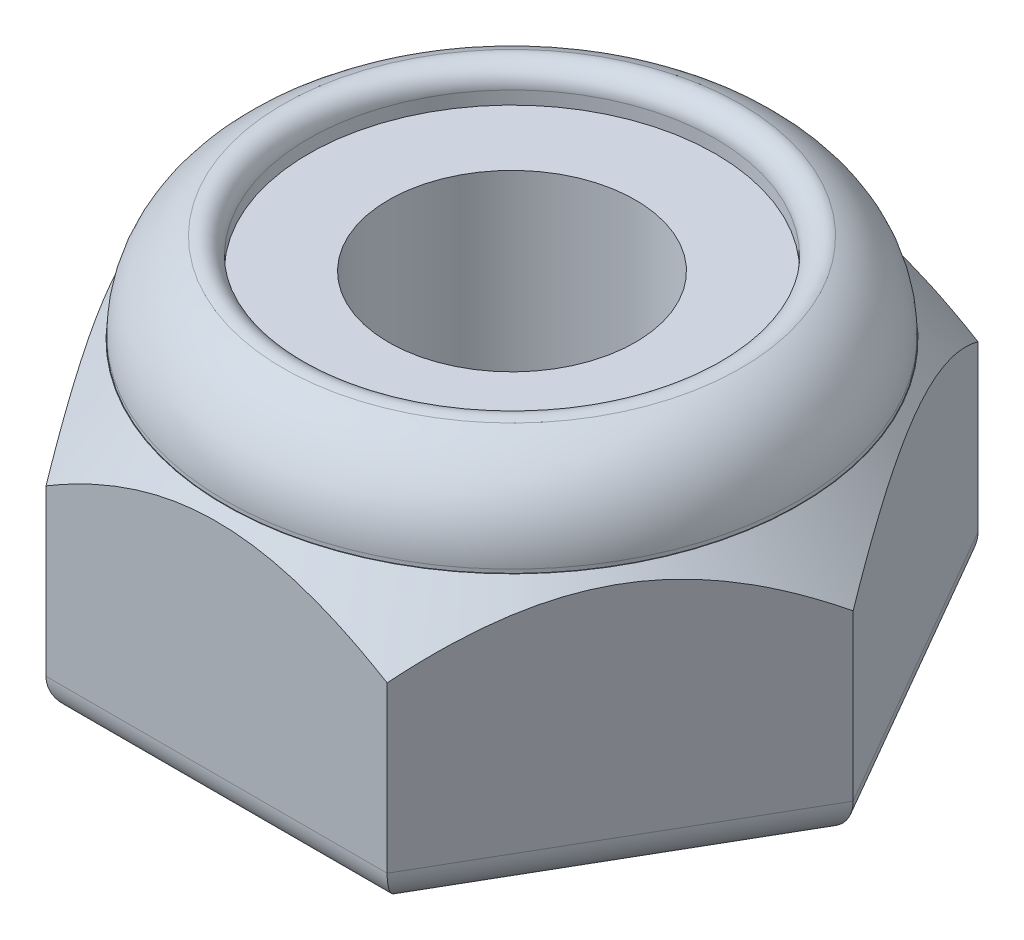
ISO-10303-21;
HEADER;
FILE_DESCRIPTION(('STEP AP214'),'2;1');
FILE_NAME('part.step','',(''),(''),'','','');
FILE_SCHEMA(('AUTOMOTIVE_DESIGN { 1 0 10303 214 1 1 1 1 }'));
ENDSEC;
DATA;
#1=APPLICATION_CONTEXT('core data for automotive mechanical design processes');
#2=APPLICATION_PROTOCOL_DEFINITION('international standard','automotive_design',2000,#1);
#3=PRODUCT_CONTEXT('',#1,'mechanical');
#4=PRODUCT('Part','Part','',(#3));
#5=PRODUCT_RELATED_PRODUCT_CATEGORY('part','',(#4));
#6=PRODUCT_DEFINITION_FORMATION('','',#4);
#7=PRODUCT_DEFINITION_CONTEXT('part definition',#1,'design');
#8=PRODUCT_DEFINITION('design','',#6,#7);
#9=PRODUCT_DEFINITION_SHAPE('','',#8);
#10=(LENGTH_UNIT() NAMED_UNIT(*) SI_UNIT(.MILLI.,.METRE.));
#11=(NAMED_UNIT(*) PLANE_ANGLE_UNIT() SI_UNIT($,.RADIAN.));
#12=(NAMED_UNIT(*) SI_UNIT($,.STERADIAN.) SOLID_ANGLE_UNIT());
#13=UNCERTAINTY_MEASURE_WITH_UNIT(LENGTH_MEASURE(1.E-05),#10,'distance_accuracy_value','');
#14=(GEOMETRIC_REPRESENTATION_CONTEXT(3) GLOBAL_UNCERTAINTY_ASSIGNED_CONTEXT((#13)) GLOBAL_UNIT_ASSIGNED_CONTEXT((#10,
#11,#12)) REPRESENTATION_CONTEXT('',''));
#15=CARTESIAN_POINT('',(0.,0.,0.));
#16=DIRECTION('',(0.,0.,1.));
#17=DIRECTION('',(1.,0.,0.));
#18=AXIS2_PLACEMENT_3D('',#15,#16,#17);
#19=CARTESIAN_POINT('',(0.,4.9784,0.));
#20=DIRECTION('',(0.,-1.,0.));
#21=DIRECTION('',(0.,0.,-1.));
#22=AXIS2_PLACEMENT_3D('',#19,#20,#21);
#23=CYLINDRICAL_SURFACE('',#22,3.937);
#24=CARTESIAN_POINT('',(0.,3.7084,0.));
#25=DIRECTION('',(0.,1.,0.));
#26=DIRECTION('',(0.,0.,1.));
#27=AXIS2_PLACEMENT_3D('',#24,#25,#26);
#28=CIRCLE('',#27,3.937);
#29=CARTESIAN_POINT('',(0.,3.7084,3.937));
#30=VERTEX_POINT('',#29);
#31=EDGE_CURVE('E243',#30,#30,#28,.T.);
#32=ORIENTED_EDGE('',*,*,#31,.F.);
#33=EDGE_LOOP('',(#32));
#34=FACE_BOUND('',#33,.T.);
#35=CARTESIAN_POINT('',(0.,3.6576,0.));
#36=DIRECTION('',(0.,-1.,0.));
#37=DIRECTION('',(0.,0.,-1.));
#38=AXIS2_PLACEMENT_3D('',#35,#36,#37);
#39=CIRCLE('',#38,3.937);
#40=CARTESIAN_POINT('',(0.,3.6576,-3.937));
#41=VERTEX_POINT('',#40);
#42=EDGE_CURVE('E19',#41,#41,#39,.F.);
#43=ORIENTED_EDGE('',*,*,#42,.T.);
#44=EDGE_LOOP('',(#43));
#45=FACE_BOUND('',#44,.T.);
#46=ADVANCED_FACE('F16',(#34,#45),#23,.T.);
#47=CARTESIAN_POINT('',(0.,3.7084,0.));
#48=DIRECTION('',(0.,1.,0.));
#49=DIRECTION('',(0.,0.,1.));
#50=AXIS2_PLACEMENT_3D('',#47,#48,#49);
#51=TOROIDAL_SURFACE('',#50,2.667,1.27);
#52=ORIENTED_EDGE('',*,*,#31,.T.);
#53=EDGE_LOOP('',(#52));
#54=FACE_BOUND('',#53,.T.);
#55=CARTESIAN_POINT('',(0.,4.88572150982644,0.));
#56=DIRECTION('',(0.,-1.,0.));
#57=DIRECTION('',(0.,0.,-1.));
#58=AXIS2_PLACEMENT_3D('',#55,#56,#57);
#59=CIRCLE('',#58,3.14325);
#60=CARTESIAN_POINT('',(0.,4.88572150982644,-3.14325));
#61=VERTEX_POINT('',#60);
#62=EDGE_CURVE('E237',#61,#61,#59,.F.);
#63=ORIENTED_EDGE('',*,*,#62,.F.);
#64=EDGE_LOOP('',(#63));
#65=FACE_BOUND('',#64,.T.);
#66=ADVANCED_FACE('F134',(#54,#65),#51,.T.);
#67=CARTESIAN_POINT('',(2.34315,3.6576,4.05845484975502));
#68=DIRECTION('',(0.,-1.,0.));
#69=DIRECTION('',(0.,0.,-1.));
#70=AXIS2_PLACEMENT_3D('',#67,#68,#69);
#71=PLANE('',#70);
#72=ORIENTED_EDGE('',*,*,#42,.F.);
#73=EDGE_LOOP('',(#72));
#74=FACE_BOUND('',#73,.T.);
#75=CARTESIAN_POINT('',(0.,3.65760000011051,0.));
#76=DIRECTION('',(0.,-1.,0.));
#77=DIRECTION('',(0.,0.,-1.));
#78=AXIS2_PLACEMENT_3D('',#75,#76,#77);
#79=CIRCLE('',#78,3.94407100938664);
#80=CARTESIAN_POINT('',(0.,3.65760000011051,-3.94407100938664));
#81=VERTEX_POINT('',#80);
#82=EDGE_CURVE('E119',#81,#81,#79,.T.);
#83=ORIENTED_EDGE('',*,*,#82,.F.);
#84=EDGE_LOOP('',(#83));
#85=FACE_BOUND('',#84,.T.);
#86=ADVANCED_FACE('F129',(#74,#85),#71,.F.);
#87=CARTESIAN_POINT('',(0.,4.65025720786115,0.));
#88=DIRECTION('',(0.,-1.,0.));
#89=DIRECTION('',(0.,0.,-1.));
#90=AXIS2_PLACEMENT_3D('',#87,#88,#89);
#91=TOROIDAL_SURFACE('',#90,3.048,0.254);
#92=CARTESIAN_POINT('',(0.,4.65025720786115,0.));
#93=DIRECTION('',(0.,1.,0.));
#94=DIRECTION('',(0.,0.,1.));
#95=AXIS2_PLACEMENT_3D('',#92,#93,#94);
#96=CIRCLE('',#95,2.794);
#97=CARTESIAN_POINT('',(0.,4.65025720786115,2.794));
#98=VERTEX_POINT('',#97);
#99=EDGE_CURVE('E104',#98,#98,#96,.F.);
#100=ORIENTED_EDGE('',*,*,#99,.T.);
#101=EDGE_LOOP('',(#100));
#102=FACE_BOUND('',#101,.T.);
#103=ORIENTED_EDGE('',*,*,#62,.T.);
#104=EDGE_LOOP('',(#103));
#105=FACE_BOUND('',#104,.T.);
#106=ADVANCED_FACE('F125',(#102,#105),#91,.T.);
#107=CARTESIAN_POINT('',(0.,2.76773860969115,0.));
#108=DIRECTION('',(0.,-1.,0.));
#109=DIRECTION('',(0.,0.,-1.));
#110=AXIS2_PLACEMENT_3D('',#107,#108,#109);
#111=CONICAL_SURFACE('',#110,4.69075337389313,0.698131700802158);
#112=CARTESIAN_POINT('',(-4.68630000001476,2.77304593398821,-5.3333815551093E-11));
#113=CARTESIAN_POINT('',(-4.65177717141793,2.81418235889091,0.0597952931149053));
#114=CARTESIAN_POINT('',(-4.61695780288956,2.85432113110728,0.120104208500933));
#115=CARTESIAN_POINT('',(-4.54666264441453,2.93230661020916,0.241858994511412));
#116=CARTESIAN_POINT('',(-4.51118655194523,2.97015222462005,0.303305389120424));
#117=CARTESIAN_POINT('',(-4.40329561885259,3.08018701500149,0.490177966909938));
#118=CARTESIAN_POINT('',(-4.32983334004397,3.14837015576205,0.617418366247689));
#119=CARTESIAN_POINT('',(-4.1797796499728,3.27092778609509,0.877318981315214));
#120=CARTESIAN_POINT('',(-4.10317943932402,3.32525984886677,1.00999443802899));
#121=CARTESIAN_POINT('',(-3.94747591651278,3.41577217646147,1.27968085045525));
#122=CARTESIAN_POINT('',(-3.86837998243724,3.45200143013375,1.4166790269463));
#123=CARTESIAN_POINT('',(-3.73746585196202,3.49372811243502,1.64342895235813));
#124=CARTESIAN_POINT('',(-3.68614686019516,3.50560413715319,1.73231605349153));
#125=CARTESIAN_POINT('',(-3.58316406708587,3.52008140702852,1.91068748346216));
#126=CARTESIAN_POINT('',(-3.53150020834088,3.5226810675312,2.00017191172355));
#127=CARTESIAN_POINT('',(-3.42855034551142,3.51847006524789,2.17848630477643));
#128=CARTESIAN_POINT('',(-3.3772638088531,3.51171021118305,2.26731719201287));
#129=CARTESIAN_POINT('',(-3.27519197708947,3.48921023555424,2.4441107906491));
#130=CARTESIAN_POINT('',(-3.22440670715057,3.4734696654174,2.53207345845939));
#131=CARTESIAN_POINT('',(-3.10963060134479,3.42817062222156,2.73087150520989));
#132=CARTESIAN_POINT('',(-3.04589899577138,3.39598542076133,2.84125788411098));
#133=CARTESIAN_POINT('',(-2.92018166739655,3.32004827846255,3.05900668424801));
#134=CARTESIAN_POINT('',(-2.85819691962206,3.27629001415058,3.16636741668776));
#135=CARTESIAN_POINT('',(-2.735889068299,3.17910361386979,3.37821082934389));
#136=CARTESIAN_POINT('',(-2.67557364738244,3.12563730731956,3.48268020285126));
#137=CARTESIAN_POINT('',(-2.55683004320588,3.01104764609313,3.68835015835892));
#138=CARTESIAN_POINT('',(-2.49840123089761,2.94992687749399,3.78955182990274));
#139=CARTESIAN_POINT('',(-2.42439626092569,2.86741854625153,3.91773219790672));
#140=CARTESIAN_POINT('',(-2.40802320106583,2.84883596648691,3.94609116945937));
#141=CARTESIAN_POINT('',(-2.3754621576302,2.81125673907332,4.00248855103733));
#142=CARTESIAN_POINT('',(-2.35927376441604,2.79226151161516,4.03052767057717));
#143=CARTESIAN_POINT('',(-2.3431499999717,2.77304593399368,4.05845484980404));
#144=B_SPLINE_CURVE_WITH_KNOTS('',3,(#112,#113,#114,#115,#116,#117,#118,#119,#120,#121,#122,
#123,#124,#125,#126,#127,#128,#129,#130,#131,#132,#133,#134,#135,#136,#137,#138,#139,#140,#141,
#142,#143),.UNSPECIFIED.,.F.,.F.,(4,2,2,2,2,2,2,2,2,2,2,2,2,2,2,4),(0.,0.241096809088565,
0.48230758945251,0.967637153847365,1.45443592242802,1.93991010956963,2.24950193433618,
2.5591466432483,2.86711700071403,3.17510274216898,3.56882084711336,3.96275452403261,
4.35827201930639,4.75365624679115,4.86660838982693,4.97921936905084),.UNSPECIFIED.);
#145=CARTESIAN_POINT('',(-4.68630000002839,2.77304593399358,0.));
#146=VERTEX_POINT('',#145);
#147=CARTESIAN_POINT('',(-2.34315000001419,2.77304593399358,4.05845484977959));
#148=VERTEX_POINT('',#147);
#149=EDGE_CURVE('E91',#146,#148,#144,.T.);
#150=ORIENTED_EDGE('',*,*,#149,.T.);
#151=CARTESIAN_POINT('',(-2.34315000005357,2.77304593398822,4.05845484974113));
#152=CARTESIAN_POINT('',(-2.27415972170409,2.81414935271336,4.05845484974989));
#153=CARTESIAN_POINT('',(-2.20457738522044,2.85425669884705,4.05845484975361));
#154=CARTESIAN_POINT('',(-2.06410193528096,2.93218331968193,4.05845484975642));
#155=CARTESIAN_POINT('',(-1.99320821641151,2.9700015013142,4.05845484975551));
#156=CARTESIAN_POINT('',(-1.77754688772429,3.07999086386455,4.05845484975401));
#157=CARTESIAN_POINT('',(-1.63068545869954,3.1481589403704,4.05845484975469));
#158=CARTESIAN_POINT('',(-1.33052752457963,3.27077676919262,4.05845484975534));
#159=CARTESIAN_POINT('',(-1.17720631609342,3.32516696804196,4.0584548497553));
#160=CARTESIAN_POINT('',(-0.865613503807779,3.41574608766059,4.05845484975473));
#161=CARTESIAN_POINT('',(-0.707359229311903,3.45199244874899,4.0584548497542));
#162=CARTESIAN_POINT('',(-0.456822143345071,3.49192146546895,4.05845484975548));
#163=CARTESIAN_POINT('',(-0.365672921156202,3.50290887295604,4.05845484975637));
#164=CARTESIAN_POINT('',(-0.183016322004482,3.51758027913678,4.05845484975366));
#165=CARTESIAN_POINT('',(-0.0915105175250817,3.52128341037061,4.05845484975007));
#166=CARTESIAN_POINT('',(0.104649468641441,3.52128177491765,4.0584548497495));
#167=CARTESIAN_POINT('',(0.209305100872023,3.51643705333648,4.05845484975354));
#168=CARTESIAN_POINT('',(0.417787181909869,3.49730239560235,4.05845484975649));
#169=CARTESIAN_POINT('',(0.521613181352877,3.48300765111694,4.05845484975541));
#170=CARTESIAN_POINT('',(0.728332544913562,3.44553375886282,4.05845484975462));
#171=CARTESIAN_POINT('',(0.831215331558566,3.42229697724238,4.05845484975491));
#172=CARTESIAN_POINT('',(1.03487580391125,3.36791830054733,4.05845484975512));
#173=CARTESIAN_POINT('',(1.13565289468809,3.33677420321768,4.05845484975504));
#174=CARTESIAN_POINT('',(1.33273383822163,3.26838741918099,4.05845484975499));
#175=CARTESIAN_POINT('',(1.42908716226035,3.23128582684656,4.05845484975501));
#176=CARTESIAN_POINT('',(1.61947291708309,3.15151071591982,4.05845484975502));
#177=CARTESIAN_POINT('',(1.71350470709807,3.10883567899407,4.05845484975502));
#178=CARTESIAN_POINT('',(1.89803195382395,3.01941532331662,4.05845484975501));
#179=CARTESIAN_POINT('',(1.98855798046432,2.97273255726059,4.05845484975502));
#180=CARTESIAN_POINT('',(2.16742834958163,2.87556944084479,4.05845484975502));
#181=CARTESIAN_POINT('',(2.25577492892455,2.82509321932285,4.05845484975502));
#182=CARTESIAN_POINT('',(2.34315000005566,2.77304593399424,4.05845484975502));
#183=B_SPLINE_CURVE_WITH_KNOTS('',3,(#151,#152,#153,#154,#155,#156,#157,#158,#159,#160,#161,
#162,#163,#164,#165,#166,#167,#168,#169,#170,#171,#172,#173,#174,#175,#176,#177,#178,#179,#180,
#181,#182),.UNSPECIFIED.,.F.,.F.,(4,2,2,2,2,2,2,2,2,2,2,2,2,2,2,4),(0.,0.24090330355952,
0.481920744736242,0.967059466968448,1.4542606837498,1.93990959177135,2.21507934695766,
2.4895253838939,2.80337599596431,3.11738642360394,3.43345557972405,3.74961286055439,
4.0591611810716,4.36879400620232,4.67425708545867,4.97939238068026),.UNSPECIFIED.);
#184=CARTESIAN_POINT('',(2.34315000001419,2.77304593399358,4.05845484977959));
#185=VERTEX_POINT('',#184);
#186=EDGE_CURVE('E83',#148,#185,#183,.T.);
#187=ORIENTED_EDGE('',*,*,#186,.T.);
#188=CARTESIAN_POINT('',(2.3431499999612,2.77304593398822,4.05845484979446));
#189=CARTESIAN_POINT('',(2.37767282857321,2.81418235889091,3.99865955663499));
#190=CARTESIAN_POINT('',(2.41249219710801,2.85432113110729,3.93835064125267));
#191=CARTESIAN_POINT('',(2.48278735558791,2.93230661020917,3.816595855245));
#192=CARTESIAN_POINT('',(2.51826344805563,2.97015222462005,3.75514946063508));
#193=CARTESIAN_POINT('',(2.62615438114571,3.08018701500149,3.56827688284408));
#194=CARTESIAN_POINT('',(2.69961665995557,3.14837015576206,3.44103648350706));
#195=CARTESIAN_POINT('',(2.84967035002766,3.2709277860951,3.18113586844006));
#196=CARTESIAN_POINT('',(2.9262705606761,3.32525984886677,3.04846041172609));
#197=CARTESIAN_POINT('',(3.08197408348711,3.41577217646148,2.77877399929969));
#198=CARTESIAN_POINT('',(3.16107001756274,3.45200143013376,2.64177582280869));
#199=CARTESIAN_POINT('',(3.291984148038,3.49372811243503,2.41502589739689));
#200=CARTESIAN_POINT('',(3.34330313980485,3.50560413715319,2.32613879626348));
#201=CARTESIAN_POINT('',(3.44628593291413,3.52008140702853,2.14776736629285));
#202=CARTESIAN_POINT('',(3.49794979165912,3.52268106753121,2.05828293803146));
#203=CARTESIAN_POINT('',(3.60089965448859,3.51847006524789,1.87996854497858));
#204=CARTESIAN_POINT('',(3.6521861911469,3.51171021118306,1.79113765774214));
#205=CARTESIAN_POINT('',(3.75425802291053,3.48921023555425,1.61434405910591));
#206=CARTESIAN_POINT('',(3.80504329284943,3.47346966541741,1.52638139129562));
#207=CARTESIAN_POINT('',(3.91981939865521,3.42817062222156,1.32758334454512));
#208=CARTESIAN_POINT('',(3.98355100422862,3.39598542076133,1.21719696564403));
#209=CARTESIAN_POINT('',(4.10926833260345,3.32004827846255,0.999448165506999));
#210=CARTESIAN_POINT('',(4.17125308037794,3.27629001415058,0.892087433067251));
#211=CARTESIAN_POINT('',(4.293560931701,3.17910361386979,0.680244020411125));
#212=CARTESIAN_POINT('',(4.35387635261756,3.12563730731956,0.575774646903749));
#213=CARTESIAN_POINT('',(4.47261995679412,3.01104764609313,0.370104691396086));
#214=CARTESIAN_POINT('',(4.53104876910239,2.94992687749399,0.268903019852268));
#215=CARTESIAN_POINT('',(4.60505373907431,2.86741854625153,0.140722651848287));
#216=CARTESIAN_POINT('',(4.62142679893417,2.84883596648691,0.112363680295636));
#217=CARTESIAN_POINT('',(4.6539878423698,2.81125673907332,0.055966298717677));
#218=CARTESIAN_POINT('',(4.67017623558396,2.79226151161516,0.0279271791778412));
#219=CARTESIAN_POINT('',(4.6863000000283,2.77304593399368,-4.90273860582746E-11));
#220=B_SPLINE_CURVE_WITH_KNOTS('',3,(#188,#189,#190,#191,#192,#193,#194,#195,#196,#197,#198,
#199,#200,#201,#202,#203,#204,#205,#206,#207,#208,#209,#210,#211,#212,#213,#214,#215,#216,#217,
#218,#219),.UNSPECIFIED.,.F.,.F.,(4,2,2,2,2,2,2,2,2,2,2,2,2,2,2,4),(0.,0.241096809088565,
0.48230758945251,0.967637153847363,1.45443592242802,1.93991010956962,2.24950193433617,
2.5591466432483,2.86711700071402,3.17510274216897,3.56882084711335,3.9627545240326,
4.35827201930639,4.75365624679114,4.86660838982692,4.97921936905084),.UNSPECIFIED.);
#221=CARTESIAN_POINT('',(4.68630000001419,2.7730459340105,-2.45821360759307E-11));
#222=VERTEX_POINT('',#221);
#223=EDGE_CURVE('E88',#185,#222,#220,.T.);
#224=ORIENTED_EDGE('',*,*,#223,.T.);
#225=CARTESIAN_POINT('',(4.68630000001476,2.77304593398822,5.33267015141622E-11));
#226=CARTESIAN_POINT('',(4.65177717141792,2.81418235889091,-0.0597952931149122));
#227=CARTESIAN_POINT('',(4.61695780288956,2.85432113110729,-0.12010420850094));
#228=CARTESIAN_POINT('',(4.54666264441452,2.93230661020917,-0.241858994511418));
#229=CARTESIAN_POINT('',(4.51118655194522,2.97015222462005,-0.303305389120429));
#230=CARTESIAN_POINT('',(4.40329561885258,3.0801870150015,-0.490177966909942));
#231=CARTESIAN_POINT('',(4.32983334004397,3.14837015576206,-0.617418366247694));
#232=CARTESIAN_POINT('',(4.1797796499728,3.27092778609509,-0.877318981315217));
#233=CARTESIAN_POINT('',(4.10317943932402,3.32525984886677,-1.00999443802899));
#234=CARTESIAN_POINT('',(3.94747591651277,3.41577217646148,-1.27968085045525));
#235=CARTESIAN_POINT('',(3.86837998243724,3.45200143013375,-1.4166790269463));
#236=CARTESIAN_POINT('',(3.73746585196202,3.49372811243502,-1.64342895235813));
#237=CARTESIAN_POINT('',(3.68614686019516,3.50560413715319,-1.73231605349153));
#238=CARTESIAN_POINT('',(3.58316406708587,3.52008140702852,-1.91068748346216));
#239=CARTESIAN_POINT('',(3.53150020834088,3.5226810675312,-2.00017191172355));
#240=CARTESIAN_POINT('',(3.42855034551142,3.51847006524789,-2.17848630477643));
#241=CARTESIAN_POINT('',(3.3772638088531,3.51171021118306,-2.26731719201287));
#242=CARTESIAN_POINT('',(3.27519197708948,3.48921023555424,-2.4441107906491));
#243=CARTESIAN_POINT('',(3.22440670715057,3.4734696654174,-2.53207345845939));
#244=CARTESIAN_POINT('',(3.10963060134479,3.42817062222156,-2.73087150520989));
#245=CARTESIAN_POINT('',(3.04589899577138,3.39598542076133,-2.84125788411098));
#246=CARTESIAN_POINT('',(2.92018166739655,3.32004827846255,-3.05900668424801));
#247=CARTESIAN_POINT('',(2.85819691962206,3.27629001415058,-3.16636741668776));
#248=CARTESIAN_POINT('',(2.735889068299,3.17910361386979,-3.37821082934388));
#249=CARTESIAN_POINT('',(2.67557364738245,3.12563730731956,-3.48268020285126));
#250=CARTESIAN_POINT('',(2.55683004320588,3.01104764609313,-3.68835015835892));
#251=CARTESIAN_POINT('',(2.49840123089762,2.94992687749399,-3.78955182990274));
#252=CARTESIAN_POINT('',(2.42439626092569,2.86741854625153,-3.91773219790672));
#253=CARTESIAN_POINT('',(2.40802320106583,2.84883596648691,-3.94609116945937));
#254=CARTESIAN_POINT('',(2.3754621576302,2.81125673907332,-4.00248855103733));
#255=CARTESIAN_POINT('',(2.35927376441604,2.79226151161516,-4.03052767057717));
#256=CARTESIAN_POINT('',(2.3431499999717,2.77304593399368,-4.05845484980404));
#257=B_SPLINE_CURVE_WITH_KNOTS('',3,(#225,#226,#227,#228,#229,#230,#231,#232,#233,#234,#235,
#236,#237,#238,#239,#240,#241,#242,#243,#244,#245,#246,#247,#248,#249,#250,#251,#252,#253,#254,
#255,#256),.UNSPECIFIED.,.F.,.F.,(4,2,2,2,2,2,2,2,2,2,2,2,2,2,2,4),(0.,0.241096809088564,
0.482307589452508,0.96763715384736,1.45443592242801,1.93991010956962,2.24950193433616,
2.55914664324829,2.86711700071401,3.17510274216896,3.56882084711335,3.96275452403259,
4.35827201930638,4.75365624679113,4.86660838982692,4.97921936905084),.UNSPECIFIED.);
#258=CARTESIAN_POINT('',(2.34315000001419,2.77304593399358,-4.0584548497796));
#259=VERTEX_POINT('',#258);
#260=EDGE_CURVE('E193',#222,#259,#257,.T.);
#261=ORIENTED_EDGE('',*,*,#260,.T.);
#262=CARTESIAN_POINT('',(2.34315000005357,2.77304593398821,-4.05845484974114));
#263=CARTESIAN_POINT('',(2.27415972170409,2.81414935271335,-4.05845484974989));
#264=CARTESIAN_POINT('',(2.20457738522045,2.85425669884704,-4.05845484975361));
#265=CARTESIAN_POINT('',(2.06410193528096,2.93218331968193,-4.05845484975643));
#266=CARTESIAN_POINT('',(1.99320821641151,2.97000150131419,-4.05845484975552));
#267=CARTESIAN_POINT('',(1.77754688772429,3.07999086386454,-4.05845484975402));
#268=CARTESIAN_POINT('',(1.63068545869954,3.1481589403704,-4.0584548497547));
#269=CARTESIAN_POINT('',(1.33052752457963,3.27077676919261,-4.05845484975534));
#270=CARTESIAN_POINT('',(1.17720631609342,3.32516696804195,-4.0584548497553));
#271=CARTESIAN_POINT('',(0.865613503807778,3.41574608766058,-4.05845484975474));
#272=CARTESIAN_POINT('',(0.707359229311901,3.45199244874898,-4.0584548497542));
#273=CARTESIAN_POINT('',(0.456822143345069,3.49192146546895,-4.05845484975548));
#274=CARTESIAN_POINT('',(0.365672921156201,3.50290887295604,-4.05845484975637));
#275=CARTESIAN_POINT('',(0.183016322004481,3.51758027913677,-4.05845484975367));
#276=CARTESIAN_POINT('',(0.0915105175250814,3.5212834103706,-4.05845484975008));
#277=CARTESIAN_POINT('',(-0.104649468641441,3.52128177491764,-4.0584548497495));
#278=CARTESIAN_POINT('',(-0.209305100872023,3.51643705333648,-4.05845484975354));
#279=CARTESIAN_POINT('',(-0.41778718190987,3.49730239560234,-4.0584548497565));
#280=CARTESIAN_POINT('',(-0.521613181352877,3.48300765111693,-4.05845484975542));
#281=CARTESIAN_POINT('',(-0.728332544913562,3.44553375886281,-4.05845484975462));
#282=CARTESIAN_POINT('',(-0.831215331558566,3.42229697724237,-4.05845484975491));
#283=CARTESIAN_POINT('',(-1.03487580391125,3.36791830054732,-4.05845484975513));
#284=CARTESIAN_POINT('',(-1.13565289468809,3.33677420321767,-4.05845484975505));
#285=CARTESIAN_POINT('',(-1.33273383822163,3.26838741918098,-4.05845484975499));
#286=CARTESIAN_POINT('',(-1.42908716226035,3.23128582684655,-4.05845484975501));
#287=CARTESIAN_POINT('',(-1.61947291708309,3.15151071591982,-4.05845484975503));
#288=CARTESIAN_POINT('',(-1.71350470709807,3.10883567899406,-4.05845484975502));
#289=CARTESIAN_POINT('',(-1.89803195382395,3.01941532331662,-4.05845484975502));
#290=CARTESIAN_POINT('',(-1.98855798046431,2.97273255726059,-4.05845484975502));
#291=CARTESIAN_POINT('',(-2.16742834958162,2.87556944084479,-4.05845484975502));
#292=CARTESIAN_POINT('',(-2.25577492892455,2.82509321932284,-4.05845484975502));
#293=CARTESIAN_POINT('',(-2.34315000005566,2.77304593399424,-4.05845484975502));
#294=B_SPLINE_CURVE_WITH_KNOTS('',3,(#262,#263,#264,#265,#266,#267,#268,#269,#270,#271,#272,
#273,#274,#275,#276,#277,#278,#279,#280,#281,#282,#283,#284,#285,#286,#287,#288,#289,#290,#291,
#292,#293),.UNSPECIFIED.,.F.,.F.,(4,2,2,2,2,2,2,2,2,2,2,2,2,2,2,4),(0.,0.24090330355952,
0.481920744736243,0.96705946696845,1.4542606837498,1.93990959177135,2.21507934695766,
2.48952538389391,2.80337599596432,3.11738642360394,3.43345557972405,3.74961286055439,
4.0591611810716,4.36879400620232,4.67425708545866,4.97939238068026),.UNSPECIFIED.);
#295=CARTESIAN_POINT('',(-2.34315000001419,2.77304593399358,-4.0584548497796));
#296=VERTEX_POINT('',#295);
#297=EDGE_CURVE('E203',#259,#296,#294,.T.);
#298=ORIENTED_EDGE('',*,*,#297,.T.);
#299=CARTESIAN_POINT('',(-2.3431499999612,2.77304593398821,-4.05845484979447));
#300=CARTESIAN_POINT('',(-2.37767282857321,2.81418235889091,-3.99865955663499));
#301=CARTESIAN_POINT('',(-2.41249219710802,2.85432113110728,-3.93835064125268));
#302=CARTESIAN_POINT('',(-2.48278735558791,2.93230661020916,-3.81659585524501));
#303=CARTESIAN_POINT('',(-2.51826344805563,2.97015222462005,-3.75514946063508));
#304=CARTESIAN_POINT('',(-2.62615438114571,3.08018701500149,-3.56827688284409));
#305=CARTESIAN_POINT('',(-2.69961665995557,3.14837015576205,-3.44103648350706));
#306=CARTESIAN_POINT('',(-2.84967035002766,3.27092778609509,-3.18113586844007));
#307=CARTESIAN_POINT('',(-2.9262705606761,3.32525984886676,-3.0484604117261));
#308=CARTESIAN_POINT('',(-3.08197408348711,3.41577217646147,-2.7787739992997));
#309=CARTESIAN_POINT('',(-3.16107001756274,3.45200143013375,-2.6417758228087));
#310=CARTESIAN_POINT('',(-3.291984148038,3.49372811243502,-2.4150258973969));
#311=CARTESIAN_POINT('',(-3.34330313980485,3.50560413715318,-2.32613879626349));
#312=CARTESIAN_POINT('',(-3.44628593291413,3.52008140702852,-2.14776736629286));
#313=CARTESIAN_POINT('',(-3.49794979165912,3.5226810675312,-2.05828293803147));
#314=CARTESIAN_POINT('',(-3.60089965448859,3.51847006524788,-1.87996854497859));
#315=CARTESIAN_POINT('',(-3.6521861911469,3.51171021118305,-1.79113765774214));
#316=CARTESIAN_POINT('',(-3.75425802291053,3.48921023555424,-1.61434405910592));
#317=CARTESIAN_POINT('',(-3.80504329284944,3.4734696654174,-1.52638139129563));
#318=CARTESIAN_POINT('',(-3.91981939865521,3.42817062222155,-1.32758334454512));
#319=CARTESIAN_POINT('',(-3.98355100422863,3.39598542076132,-1.21719696564403));
#320=CARTESIAN_POINT('',(-4.10926833260346,3.32004827846254,-0.999448165507007));
#321=CARTESIAN_POINT('',(-4.17125308037794,3.27629001415057,-0.892087433067258));
#322=CARTESIAN_POINT('',(-4.29356093170101,3.17910361386978,-0.680244020411132));
#323=CARTESIAN_POINT('',(-4.35387635261756,3.12563730731955,-0.575774646903757));
#324=CARTESIAN_POINT('',(-4.47261995679413,3.01104764609312,-0.370104691396094));
#325=CARTESIAN_POINT('',(-4.53104876910239,2.94992687749399,-0.268903019852276));
#326=CARTESIAN_POINT('',(-4.60505373907432,2.86741854625152,-0.140722651848295));
#327=CARTESIAN_POINT('',(-4.62142679893418,2.84883596648691,-0.112363680295645));
#328=CARTESIAN_POINT('',(-4.6539878423698,2.81125673907331,-0.0559662987176857));
#329=CARTESIAN_POINT('',(-4.67017623558397,2.79226151161515,-0.0279271791778497));
#330=CARTESIAN_POINT('',(-4.68630000002831,2.77304593399367,4.90190782069009E-11));
#331=B_SPLINE_CURVE_WITH_KNOTS('',3,(#299,#300,#301,#302,#303,#304,#305,#306,#307,#308,#309,
#310,#311,#312,#313,#314,#315,#316,#317,#318,#319,#320,#321,#322,#323,#324,#325,#326,#327,#328,
#329,#330),.UNSPECIFIED.,.F.,.F.,(4,2,2,2,2,2,2,2,2,2,2,2,2,2,2,4),(0.,0.241096809088564,
0.482307589452509,0.967637153847362,1.45443592242802,1.93991010956962,2.24950193433617,
2.5591466432483,2.86711700071402,3.17510274216897,3.56882084711335,3.9627545240326,
4.35827201930639,4.75365624679114,4.86660838982692,4.97921936905084),.UNSPECIFIED.);
#332=EDGE_CURVE('E209',#296,#146,#331,.T.);
#333=ORIENTED_EDGE('',*,*,#332,.T.);
#334=EDGE_LOOP('',(#150,#187,#224,#261,#298,#333));
#335=FACE_BOUND('',#334,.T.);
#336=ORIENTED_EDGE('',*,*,#82,.T.);
#337=EDGE_LOOP('',(#336));
#338=FACE_BOUND('',#337,.T.);
#339=ADVANCED_FACE('F85',(#335,#338),#111,.T.);
#340=CARTESIAN_POINT('',(0.,4.4704,0.));
#341=DIRECTION('',(0.,1.,0.));
#342=DIRECTION('',(0.,0.,1.));
#343=AXIS2_PLACEMENT_3D('',#340,#341,#342);
#344=CYLINDRICAL_SURFACE('',#343,2.794);
#345=ORIENTED_EDGE('',*,*,#99,.F.);
#346=EDGE_LOOP('',(#345));
#347=FACE_BOUND('',#346,.T.);
#348=CARTESIAN_POINT('',(0.,4.4704,0.));
#349=DIRECTION('',(0.,1.,0.));
#350=DIRECTION('',(0.,0.,1.));
#351=AXIS2_PLACEMENT_3D('',#348,#349,#350);
#352=CIRCLE('',#351,2.794);
#353=CARTESIAN_POINT('',(0.,4.4704,2.794));
#354=VERTEX_POINT('',#353);
#355=EDGE_CURVE('E201',#354,#354,#352,.T.);
#356=ORIENTED_EDGE('',*,*,#355,.F.);
#357=EDGE_LOOP('',(#356));
#358=FACE_BOUND('',#357,.T.);
#359=ADVANCED_FACE('F405',(#347,#358),#344,.F.);
#360=CARTESIAN_POINT('',(2.34315,3.6576,4.05845484975502));
#361=DIRECTION('',(-0.866025403784439,0.,-0.499999999999999));
#362=DIRECTION('',(-0.499999999999999,0.,0.866025403784439));
#363=AXIS2_PLACEMENT_3D('',#360,#361,#362);
#364=PLANE('',#363);
#365=DIRECTION('',(-0.499999999999999,0.,0.866025403784439));
#366=VECTOR('',#365,1.);
#367=CARTESIAN_POINT('',(2.34315,0.508,4.05845484975502));
#368=LINE('',#367,#366);
#369=CARTESIAN_POINT('',(4.6863,0.508,0.));
#370=VERTEX_POINT('',#369);
#371=CARTESIAN_POINT('',(2.34315000000001,0.508,4.05845484975502));
#372=VERTEX_POINT('',#371);
#373=EDGE_CURVE('E267',#370,#372,#368,.T.);
#374=ORIENTED_EDGE('',*,*,#373,.F.);
#375=DIRECTION('',(0.,1.,0.));
#376=VECTOR('',#375,1.);
#377=CARTESIAN_POINT('',(4.6863,3.6576,0.));
#378=LINE('',#377,#376);
#379=EDGE_CURVE('E102',#370,#222,#378,.T.);
#380=ORIENTED_EDGE('',*,*,#379,.T.);
#381=ORIENTED_EDGE('',*,*,#223,.F.);
#382=DIRECTION('',(0.,1.,0.));
#383=VECTOR('',#382,1.);
#384=CARTESIAN_POINT('',(2.34315000000001,3.6576,4.05845484975502));
#385=LINE('',#384,#383);
#386=EDGE_CURVE('E95',#185,#372,#385,.F.);
#387=ORIENTED_EDGE('',*,*,#386,.T.);
#388=EDGE_LOOP('',(#374,#380,#381,#387));
#389=FACE_BOUND('',#388,.T.);
#390=ADVANCED_FACE('F99',(#389),#364,.F.);
#391=CARTESIAN_POINT('',(-2.34315,3.6576,4.05845484975501));
#392=DIRECTION('',(0.,0.,-1.));
#393=DIRECTION('',(-1.,0.,0.));
#394=AXIS2_PLACEMENT_3D('',#391,#392,#393);
#395=PLANE('',#394);
#396=DIRECTION('',(-1.,0.,0.));
#397=VECTOR('',#396,1.);
#398=CARTESIAN_POINT('',(-2.34315,0.508,4.05845484975501));
#399=LINE('',#398,#397);
#400=CARTESIAN_POINT('',(-2.34315,0.508,4.05845484975501));
#401=VERTEX_POINT('',#400);
#402=EDGE_CURVE('E109',#372,#401,#399,.T.);
#403=ORIENTED_EDGE('',*,*,#402,.F.);
#404=ORIENTED_EDGE('',*,*,#386,.F.);
#405=ORIENTED_EDGE('',*,*,#186,.F.);
#406=DIRECTION('',(0.,1.,0.));
#407=VECTOR('',#406,1.);
#408=CARTESIAN_POINT('',(-2.34315,3.6576,4.05845484975501));
#409=LINE('',#408,#407);
#410=EDGE_CURVE('E112',#148,#401,#409,.F.);
#411=ORIENTED_EDGE('',*,*,#410,.T.);
#412=EDGE_LOOP('',(#403,#404,#405,#411));
#413=FACE_BOUND('',#412,.T.);
#414=ADVANCED_FACE('F107',(#413),#395,.F.);
#415=CARTESIAN_POINT('',(-4.6863,3.6576,0.));
#416=DIRECTION('',(0.866025403784439,0.,-0.5));
#417=DIRECTION('',(-0.5,0.,-0.866025403784439));
#418=AXIS2_PLACEMENT_3D('',#415,#416,#417);
#419=PLANE('',#418);
#420=DIRECTION('',(-0.5,0.,-0.866025403784439));
#421=VECTOR('',#420,1.);
#422=CARTESIAN_POINT('',(-4.6863,0.508,0.));
#423=LINE('',#422,#421);
#424=CARTESIAN_POINT('',(-4.6863,0.508,0.));
#425=VERTEX_POINT('',#424);
#426=EDGE_CURVE('E263',#401,#425,#423,.T.);
#427=ORIENTED_EDGE('',*,*,#426,.F.);
#428=ORIENTED_EDGE('',*,*,#410,.F.);
#429=ORIENTED_EDGE('',*,*,#149,.F.);
#430=DIRECTION('',(0.,1.,0.));
#431=VECTOR('',#430,1.);
#432=CARTESIAN_POINT('',(-4.6863,3.6576,0.));
#433=LINE('',#432,#431);
#434=EDGE_CURVE('E208',#146,#425,#433,.F.);
#435=ORIENTED_EDGE('',*,*,#434,.T.);
#436=EDGE_LOOP('',(#427,#428,#429,#435));
#437=FACE_BOUND('',#436,.T.);
#438=ADVANCED_FACE('F220',(#437),#419,.F.);
#439=CARTESIAN_POINT('',(-2.34315,3.6576,-4.05845484975502));
#440=DIRECTION('',(0.866025403784438,0.,0.5));
#441=DIRECTION('',(0.5,0.,-0.866025403784438));
#442=AXIS2_PLACEMENT_3D('',#439,#440,#441);
#443=PLANE('',#442);
#444=DIRECTION('',(0.5,0.,-0.866025403784438));
#445=VECTOR('',#444,1.);
#446=CARTESIAN_POINT('',(-2.34315,0.508,-4.05845484975502));
#447=LINE('',#446,#445);
#448=CARTESIAN_POINT('',(-2.34315,0.508,-4.05845484975502));
#449=VERTEX_POINT('',#448);
#450=EDGE_CURVE('E259',#425,#449,#447,.T.);
#451=ORIENTED_EDGE('',*,*,#450,.F.);
#452=ORIENTED_EDGE('',*,*,#434,.F.);
#453=ORIENTED_EDGE('',*,*,#332,.F.);
#454=DIRECTION('',(0.,1.,0.));
#455=VECTOR('',#454,1.);
#456=CARTESIAN_POINT('',(-2.34315,3.6576,-4.05845484975502));
#457=LINE('',#456,#455);
#458=EDGE_CURVE('E200',#296,#449,#457,.F.);
#459=ORIENTED_EDGE('',*,*,#458,.T.);
#460=EDGE_LOOP('',(#451,#452,#453,#459));
#461=FACE_BOUND('',#460,.T.);
#462=ADVANCED_FACE('F217',(#461),#443,.F.);
#463=CARTESIAN_POINT('',(2.34315,3.6576,-4.05845484975502));
#464=DIRECTION('',(0.,0.,1.));
#465=DIRECTION('',(1.,0.,0.));
#466=AXIS2_PLACEMENT_3D('',#463,#464,#465);
#467=PLANE('',#466);
#468=DIRECTION('',(1.,0.,0.));
#469=VECTOR('',#468,1.);
#470=CARTESIAN_POINT('',(2.34315,0.508,-4.05845484975502));
#471=LINE('',#470,#469);
#472=CARTESIAN_POINT('',(2.34315,0.508,-4.05845484975502));
#473=VERTEX_POINT('',#472);
#474=EDGE_CURVE('E255',#449,#473,#471,.T.);
#475=ORIENTED_EDGE('',*,*,#474,.F.);
#476=ORIENTED_EDGE('',*,*,#458,.F.);
#477=ORIENTED_EDGE('',*,*,#297,.F.);
#478=DIRECTION('',(0.,1.,0.));
#479=VECTOR('',#478,1.);
#480=CARTESIAN_POINT('',(2.34315,3.6576,-4.05845484975501));
#481=LINE('',#480,#479);
#482=EDGE_CURVE('E199',#259,#473,#481,.F.);
#483=ORIENTED_EDGE('',*,*,#482,.T.);
#484=EDGE_LOOP('',(#475,#476,#477,#483));
#485=FACE_BOUND('',#484,.T.);
#486=ADVANCED_FACE('F188',(#485),#467,.F.);
#487=CARTESIAN_POINT('',(4.6863,3.6576,0.));
#488=DIRECTION('',(-0.866025403784439,0.,0.5));
#489=DIRECTION('',(0.5,0.,0.866025403784439));
#490=AXIS2_PLACEMENT_3D('',#487,#488,#489);
#491=PLANE('',#490);
#492=DIRECTION('',(0.5,0.,0.866025403784439));
#493=VECTOR('',#492,1.);
#494=CARTESIAN_POINT('',(4.6863,0.508,0.));
#495=LINE('',#494,#493);
#496=EDGE_CURVE('E253',#473,#370,#495,.T.);
#497=ORIENTED_EDGE('',*,*,#496,.F.);
#498=ORIENTED_EDGE('',*,*,#482,.F.);
#499=ORIENTED_EDGE('',*,*,#260,.F.);
#500=ORIENTED_EDGE('',*,*,#379,.F.);
#501=EDGE_LOOP('',(#497,#498,#499,#500));
#502=FACE_BOUND('',#501,.T.);
#503=ADVANCED_FACE('F183',(#502),#491,.F.);
#504=CARTESIAN_POINT('',(0.,4.4704,0.));
#505=DIRECTION('',(0.,1.,0.));
#506=DIRECTION('',(0.,0.,1.));
#507=AXIS2_PLACEMENT_3D('',#504,#505,#506);
#508=PLANE('',#507);
#509=CARTESIAN_POINT('',(0.,4.4704,0.));
#510=DIRECTION('',(0.,1.,0.));
#511=DIRECTION('',(0.,0.,1.));
#512=AXIS2_PLACEMENT_3D('',#509,#510,#511);
#513=CIRCLE('',#512,1.69545);
#514=CARTESIAN_POINT('',(0.,4.4704,1.69545));
#515=VERTEX_POINT('',#514);
#516=EDGE_CURVE('E246',#515,#515,#513,.F.);
#517=ORIENTED_EDGE('',*,*,#516,.T.);
#518=EDGE_LOOP('',(#517));
#519=FACE_BOUND('',#518,.T.);
#520=ORIENTED_EDGE('',*,*,#355,.T.);
#521=EDGE_LOOP('',(#520));
#522=FACE_BOUND('',#521,.T.);
#523=ADVANCED_FACE('F179',(#519,#522),#508,.T.);
#524=CARTESIAN_POINT('',(1.9032090948775,0.508,3.80445484975502));
#525=DIRECTION('',(-0.499999999999999,0.,0.866025403784439));
#526=DIRECTION('',(0.866025403784439,0.,0.499999999999999));
#527=AXIS2_PLACEMENT_3D('',#524,#525,#526);
#528=CYLINDRICAL_SURFACE('',#527,0.508);
#529=CARTESIAN_POINT('',(2.04985606325167,0.508,3.55045484975502));
#530=DIRECTION('',(-0.866025403784439,0.,0.5));
#531=DIRECTION('',(-0.5,0.,-0.866025403784439));
#532=AXIS2_PLACEMENT_3D('',#529,#530,#531);
#533=ELLIPSE('',#532,0.58658787349666,0.508);
#534=CARTESIAN_POINT('',(2.04985606325167,0.,3.55045484975502));
#535=VERTEX_POINT('',#534);
#536=EDGE_CURVE('E266',#535,#372,#533,.T.);
#537=ORIENTED_EDGE('',*,*,#536,.F.);
#538=DIRECTION('',(-0.499999999999999,0.,0.866025403784439));
#539=VECTOR('',#538,1.);
#540=CARTESIAN_POINT('',(4.09971212650334,0.,0.));
#541=LINE('',#540,#539);
#542=CARTESIAN_POINT('',(4.09971212650334,0.,0.));
#543=VERTEX_POINT('',#542);
#544=EDGE_CURVE('E249',#543,#535,#541,.T.);
#545=ORIENTED_EDGE('',*,*,#544,.F.);
#546=CARTESIAN_POINT('',(4.09971212650334,0.508,0.));
#547=DIRECTION('',(0.,0.,1.));
#548=DIRECTION('',(1.,0.,0.));
#549=AXIS2_PLACEMENT_3D('',#546,#547,#548);
#550=ELLIPSE('',#549,0.58658787349666,0.508);
#551=EDGE_CURVE('E250',#370,#543,#550,.F.);
#552=ORIENTED_EDGE('',*,*,#551,.F.);
#553=ORIENTED_EDGE('',*,*,#373,.T.);
#554=EDGE_LOOP('',(#537,#545,#552,#553));
#555=FACE_BOUND('',#554,.T.);
#556=ADVANCED_FACE('F175',(#555),#528,.T.);
#557=CARTESIAN_POINT('',(-2.34315,0.508,3.55045484975501));
#558=DIRECTION('',(-1.,0.,0.));
#559=DIRECTION('',(0.,0.,1.));
#560=AXIS2_PLACEMENT_3D('',#557,#558,#559);
#561=CYLINDRICAL_SURFACE('',#560,0.508);
#562=ORIENTED_EDGE('',*,*,#536,.T.);
#563=ORIENTED_EDGE('',*,*,#402,.T.);
#564=CARTESIAN_POINT('',(-2.04985606325167,0.508,3.55045484975501));
#565=DIRECTION('',(-0.866025403784439,0.,-0.5));
#566=DIRECTION('',(0.5,0.,-0.866025403784439));
#567=AXIS2_PLACEMENT_3D('',#564,#565,#566);
#568=ELLIPSE('',#567,0.58658787349666,0.508);
#569=CARTESIAN_POINT('',(-2.04985606325167,0.,3.55045484975502));
#570=VERTEX_POINT('',#569);
#571=EDGE_CURVE('E264',#570,#401,#568,.T.);
#572=ORIENTED_EDGE('',*,*,#571,.F.);
#573=DIRECTION('',(1.,0.,0.));
#574=VECTOR('',#573,1.);
#575=CARTESIAN_POINT('',(2.34315,0.,3.55045484975502));
#576=LINE('',#575,#574);
#577=EDGE_CURVE('E298',#535,#570,#576,.F.);
#578=ORIENTED_EDGE('',*,*,#577,.F.);
#579=EDGE_LOOP('',(#562,#563,#572,#578));
#580=FACE_BOUND('',#579,.T.);
#581=ADVANCED_FACE('F171',(#580),#561,.T.);
#582=CARTESIAN_POINT('',(-4.24635909487751,0.508,-0.254000000000004));
#583=DIRECTION('',(-0.5,0.,-0.866025403784439));
#584=DIRECTION('',(-0.866025403784439,0.,0.5));
#585=AXIS2_PLACEMENT_3D('',#582,#583,#584);
#586=CYLINDRICAL_SURFACE('',#585,0.508);
#587=ORIENTED_EDGE('',*,*,#571,.T.);
#588=ORIENTED_EDGE('',*,*,#426,.T.);
#589=CARTESIAN_POINT('',(-4.09971212650334,0.508,0.));
#590=DIRECTION('',(0.,0.,-1.));
#591=DIRECTION('',(1.,0.,0.));
#592=AXIS2_PLACEMENT_3D('',#589,#590,#591);
#593=ELLIPSE('',#592,0.58658787349666,0.508);
#594=CARTESIAN_POINT('',(-4.09971212650334,0.,0.));
#595=VERTEX_POINT('',#594);
#596=EDGE_CURVE('E260',#595,#425,#593,.T.);
#597=ORIENTED_EDGE('',*,*,#596,.F.);
#598=DIRECTION('',(-0.5,0.,-0.866025403784439));
#599=VECTOR('',#598,1.);
#600=CARTESIAN_POINT('',(-2.04985606325167,0.,3.55045484975501));
#601=LINE('',#600,#599);
#602=EDGE_CURVE('E294',#570,#595,#601,.T.);
#603=ORIENTED_EDGE('',*,*,#602,.F.);
#604=EDGE_LOOP('',(#587,#588,#597,#603));
#605=FACE_BOUND('',#604,.T.);
#606=ADVANCED_FACE('F167',(#605),#586,.T.);
#607=CARTESIAN_POINT('',(-1.90320909487751,0.508,-3.80445484975502));
#608=DIRECTION('',(0.5,0.,-0.866025403784438));
#609=DIRECTION('',(-0.866025403784438,0.,-0.5));
#610=AXIS2_PLACEMENT_3D('',#607,#608,#609);
#611=CYLINDRICAL_SURFACE('',#610,0.508);
#612=ORIENTED_EDGE('',*,*,#596,.T.);
#613=ORIENTED_EDGE('',*,*,#450,.T.);
#614=CARTESIAN_POINT('',(-2.04985606325167,0.508,-3.55045484975502));
#615=DIRECTION('',(0.866025403784439,0.,-0.5));
#616=DIRECTION('',(0.5,0.,0.866025403784439));
#617=AXIS2_PLACEMENT_3D('',#614,#615,#616);
#618=ELLIPSE('',#617,0.58658787349666,0.508);
#619=CARTESIAN_POINT('',(-2.04985606325167,0.,-3.55045484975502));
#620=VERTEX_POINT('',#619);
#621=EDGE_CURVE('E256',#620,#449,#618,.T.);
#622=ORIENTED_EDGE('',*,*,#621,.F.);
#623=DIRECTION('',(0.5,0.,-0.866025403784438));
#624=VECTOR('',#623,1.);
#625=CARTESIAN_POINT('',(-4.09971212650334,0.,0.));
#626=LINE('',#625,#624);
#627=EDGE_CURVE('E290',#595,#620,#626,.T.);
#628=ORIENTED_EDGE('',*,*,#627,.F.);
#629=EDGE_LOOP('',(#612,#613,#622,#628));
#630=FACE_BOUND('',#629,.T.);
#631=ADVANCED_FACE('F164',(#630),#611,.T.);
#632=CARTESIAN_POINT('',(2.34315,0.508,-3.55045484975502));
#633=DIRECTION('',(1.,0.,0.));
#634=DIRECTION('',(0.,0.,-1.));
#635=AXIS2_PLACEMENT_3D('',#632,#633,#634);
#636=CYLINDRICAL_SURFACE('',#635,0.508);
#637=ORIENTED_EDGE('',*,*,#621,.T.);
#638=ORIENTED_EDGE('',*,*,#474,.T.);
#639=CARTESIAN_POINT('',(2.04985606325167,0.508,-3.55045484975502));
#640=DIRECTION('',(0.866025403784439,0.,0.5));
#641=DIRECTION('',(-0.5,0.,0.866025403784439));
#642=AXIS2_PLACEMENT_3D('',#639,#640,#641);
#643=ELLIPSE('',#642,0.58658787349666,0.508);
#644=CARTESIAN_POINT('',(2.04985606325167,0.,-3.55045484975502));
#645=VERTEX_POINT('',#644);
#646=EDGE_CURVE('E34',#645,#473,#643,.T.);
#647=ORIENTED_EDGE('',*,*,#646,.F.);
#648=DIRECTION('',(1.,0.,0.));
#649=VECTOR('',#648,1.);
#650=CARTESIAN_POINT('',(2.34315,0.,-3.55045484975502));
#651=LINE('',#650,#649);
#652=EDGE_CURVE('E293',#620,#645,#651,.T.);
#653=ORIENTED_EDGE('',*,*,#652,.F.);
#654=EDGE_LOOP('',(#637,#638,#647,#653));
#655=FACE_BOUND('',#654,.T.);
#656=ADVANCED_FACE('F160',(#655),#636,.T.);
#657=CARTESIAN_POINT('',(4.2463590948775,0.508,0.253999999999996));
#658=DIRECTION('',(0.5,0.,0.866025403784439));
#659=DIRECTION('',(0.866025403784439,0.,-0.5));
#660=AXIS2_PLACEMENT_3D('',#657,#658,#659);
#661=CYLINDRICAL_SURFACE('',#660,0.508);
#662=ORIENTED_EDGE('',*,*,#551,.T.);
#663=DIRECTION('',(0.5,0.,0.866025403784439));
#664=VECTOR('',#663,1.);
#665=CARTESIAN_POINT('',(2.04985606325167,0.,-3.55045484975502));
#666=LINE('',#665,#664);
#667=EDGE_CURVE('E25',#645,#543,#666,.T.);
#668=ORIENTED_EDGE('',*,*,#667,.F.);
#669=ORIENTED_EDGE('',*,*,#646,.T.);
#670=ORIENTED_EDGE('',*,*,#496,.T.);
#671=EDGE_LOOP('',(#662,#668,#669,#670));
#672=FACE_BOUND('',#671,.T.);
#673=ADVANCED_FACE('F153',(#672),#661,.T.);
#674=CARTESIAN_POINT('',(0.,0.,0.));
#675=DIRECTION('',(0.,1.,0.));
#676=DIRECTION('',(0.,0.,1.));
#677=AXIS2_PLACEMENT_3D('',#674,#675,#676);
#678=CYLINDRICAL_SURFACE('',#677,1.69545);
#679=ORIENTED_EDGE('',*,*,#516,.F.);
#680=EDGE_LOOP('',(#679));
#681=FACE_BOUND('',#680,.T.);
#682=CARTESIAN_POINT('',(0.,0.,0.));
#683=DIRECTION('',(0.,1.,0.));
#684=DIRECTION('',(0.,0.,1.));
#685=AXIS2_PLACEMENT_3D('',#682,#683,#684);
#686=CIRCLE('',#685,1.69545);
#687=CARTESIAN_POINT('',(0.,0.,1.69545));
#688=VERTEX_POINT('',#687);
#689=EDGE_CURVE('E11',#688,#688,#686,.T.);
#690=ORIENTED_EDGE('',*,*,#689,.F.);
#691=EDGE_LOOP('',(#690));
#692=FACE_BOUND('',#691,.T.);
#693=ADVANCED_FACE('F147',(#681,#692),#678,.F.);
#694=CARTESIAN_POINT('',(2.34315,0.,4.05845484975502));
#695=DIRECTION('',(0.,-1.,0.));
#696=DIRECTION('',(0.,0.,-1.));
#697=AXIS2_PLACEMENT_3D('',#694,#695,#696);
#698=PLANE('',#697);
#699=ORIENTED_EDGE('',*,*,#689,.T.);
#700=EDGE_LOOP('',(#699));
#701=FACE_BOUND('',#700,.T.);
#702=ORIENTED_EDGE('',*,*,#652,.T.);
#703=ORIENTED_EDGE('',*,*,#667,.T.);
#704=ORIENTED_EDGE('',*,*,#544,.T.);
#705=ORIENTED_EDGE('',*,*,#577,.T.);
#706=ORIENTED_EDGE('',*,*,#602,.T.);
#707=ORIENTED_EDGE('',*,*,#627,.T.);
#708=EDGE_LOOP('',(#702,#703,#704,#705,#706,#707));
#709=FACE_BOUND('',#708,.T.);
#710=ADVANCED_FACE('F145',(#701,#709),#698,.T.);
#711=CLOSED_SHELL('',(#46,#66,#86,#106,#339,#359,#390,#414,#438,#462,#486,#503,#523,#556,#581,
#606,#631,#656,#673,#693,#710));
#712=MANIFOLD_SOLID_BREP('B1',#711);
#713=ADVANCED_BREP_SHAPE_REPRESENTATION('',(#18,#712),#14);
#714=SHAPE_DEFINITION_REPRESENTATION(#9,#713);
ENDSEC;
END-ISO-10303-21;
